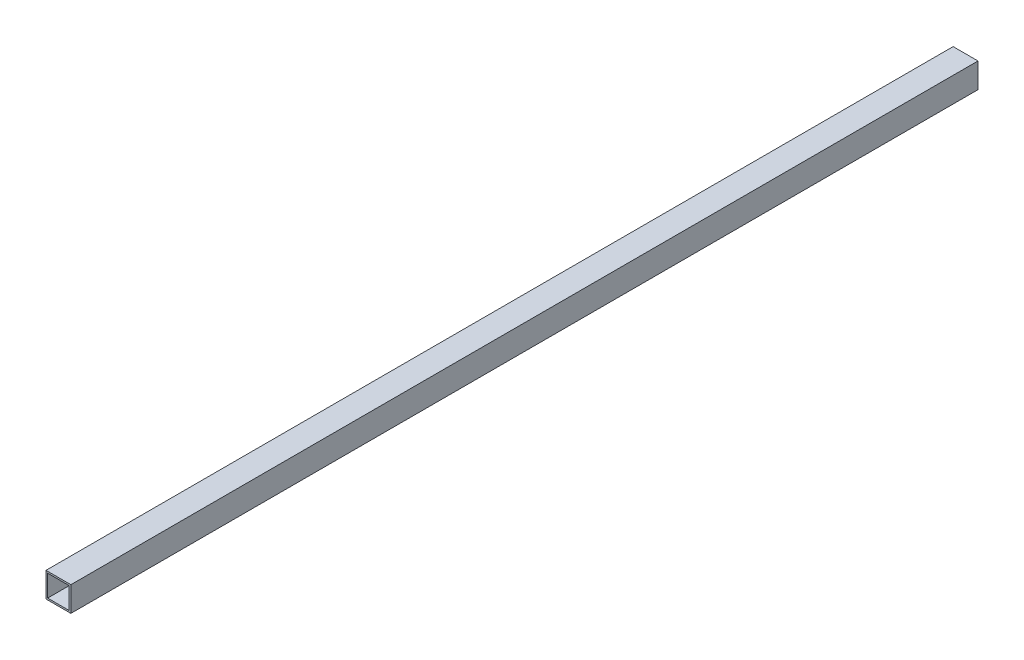
ISO-10303-21;
HEADER;
FILE_DESCRIPTION(('STEP AP214'),'2;1');
FILE_NAME('part.step','',(''),(''),'','','');
FILE_SCHEMA(('AUTOMOTIVE_DESIGN { 1 0 10303 214 1 1 1 1 }'));
ENDSEC;
DATA;
#1=APPLICATION_CONTEXT('core data for automotive mechanical design processes');
#2=APPLICATION_PROTOCOL_DEFINITION('international standard','automotive_design',2000,#1);
#3=PRODUCT_CONTEXT('',#1,'mechanical');
#4=PRODUCT('Part','Part','',(#3));
#5=PRODUCT_RELATED_PRODUCT_CATEGORY('part','',(#4));
#6=PRODUCT_DEFINITION_FORMATION('','',#4);
#7=PRODUCT_DEFINITION_CONTEXT('part definition',#1,'design');
#8=PRODUCT_DEFINITION('design','',#6,#7);
#9=PRODUCT_DEFINITION_SHAPE('','',#8);
#10=(LENGTH_UNIT() NAMED_UNIT(*) SI_UNIT(.MILLI.,.METRE.));
#11=(NAMED_UNIT(*) PLANE_ANGLE_UNIT() SI_UNIT($,.RADIAN.));
#12=(NAMED_UNIT(*) SI_UNIT($,.STERADIAN.) SOLID_ANGLE_UNIT());
#13=UNCERTAINTY_MEASURE_WITH_UNIT(LENGTH_MEASURE(1.E-05),#10,'distance_accuracy_value','');
#14=(GEOMETRIC_REPRESENTATION_CONTEXT(3) GLOBAL_UNCERTAINTY_ASSIGNED_CONTEXT((#13)) GLOBAL_UNIT_ASSIGNED_CONTEXT((#10,
#11,#12)) REPRESENTATION_CONTEXT('',''));
#15=CARTESIAN_POINT('',(0.,0.,0.));
#16=DIRECTION('',(0.,0.,1.));
#17=DIRECTION('',(1.,0.,0.));
#18=AXIS2_PLACEMENT_3D('',#15,#16,#17);
#19=CARTESIAN_POINT('',(-30.,30.,0.));
#20=DIRECTION('',(-1.,0.,0.));
#21=DIRECTION('',(0.,0.,1.));
#22=AXIS2_PLACEMENT_3D('',#19,#20,#21);
#23=PLANE('',#22);
#24=DIRECTION('',(0.,0.,1.));
#25=VECTOR('',#24,1.);
#26=CARTESIAN_POINT('',(-30.,-30.,0.));
#27=LINE('',#26,#25);
#28=CARTESIAN_POINT('',(-30.,-30.,0.));
#29=VERTEX_POINT('',#28);
#30=CARTESIAN_POINT('',(-30.,-30.,2188.));
#31=VERTEX_POINT('',#30);
#32=EDGE_CURVE('E92',#29,#31,#27,.T.);
#33=ORIENTED_EDGE('',*,*,#32,.T.);
#34=DIRECTION('',(0.,-1.,0.));
#35=VECTOR('',#34,1.);
#36=CARTESIAN_POINT('',(-30.,30.,2188.));
#37=LINE('',#36,#35);
#38=CARTESIAN_POINT('',(-30.,30.,2188.));
#39=VERTEX_POINT('',#38);
#40=EDGE_CURVE('E114',#39,#31,#37,.T.);
#41=ORIENTED_EDGE('',*,*,#40,.F.);
#42=DIRECTION('',(0.,0.,1.));
#43=VECTOR('',#42,1.);
#44=CARTESIAN_POINT('',(-30.,30.,0.));
#45=LINE('',#44,#43);
#46=CARTESIAN_POINT('',(-30.,30.,0.));
#47=VERTEX_POINT('',#46);
#48=EDGE_CURVE('E95',#47,#39,#45,.T.);
#49=ORIENTED_EDGE('',*,*,#48,.F.);
#50=DIRECTION('',(0.,-1.,0.));
#51=VECTOR('',#50,1.);
#52=CARTESIAN_POINT('',(-30.,30.,0.));
#53=LINE('',#52,#51);
#54=EDGE_CURVE('E91',#47,#29,#53,.T.);
#55=ORIENTED_EDGE('',*,*,#54,.T.);
#56=EDGE_LOOP('',(#33,#41,#49,#55));
#57=FACE_BOUND('',#56,.T.);
#58=ADVANCED_FACE('F35',(#57),#23,.T.);
#59=CARTESIAN_POINT('',(-30.,-30.,0.));
#60=DIRECTION('',(0.,-1.,0.));
#61=DIRECTION('',(0.,0.,-1.));
#62=AXIS2_PLACEMENT_3D('',#59,#60,#61);
#63=PLANE('',#62);
#64=DIRECTION('',(0.,0.,1.));
#65=VECTOR('',#64,1.);
#66=CARTESIAN_POINT('',(30.,-30.,0.));
#67=LINE('',#66,#65);
#68=CARTESIAN_POINT('',(30.,-30.,0.));
#69=VERTEX_POINT('',#68);
#70=CARTESIAN_POINT('',(30.,-30.,2188.));
#71=VERTEX_POINT('',#70);
#72=EDGE_CURVE('E102',#69,#71,#67,.T.);
#73=ORIENTED_EDGE('',*,*,#72,.T.);
#74=DIRECTION('',(1.,0.,0.));
#75=VECTOR('',#74,1.);
#76=CARTESIAN_POINT('',(-30.,-30.,2188.));
#77=LINE('',#76,#75);
#78=EDGE_CURVE('E101',#31,#71,#77,.T.);
#79=ORIENTED_EDGE('',*,*,#78,.F.);
#80=ORIENTED_EDGE('',*,*,#32,.F.);
#81=DIRECTION('',(1.,0.,0.));
#82=VECTOR('',#81,1.);
#83=CARTESIAN_POINT('',(-30.,-30.,0.));
#84=LINE('',#83,#82);
#85=EDGE_CURVE('E84',#29,#69,#84,.T.);
#86=ORIENTED_EDGE('',*,*,#85,.T.);
#87=EDGE_LOOP('',(#73,#79,#80,#86));
#88=FACE_BOUND('',#87,.T.);
#89=ADVANCED_FACE('F99',(#88),#63,.T.);
#90=CARTESIAN_POINT('',(30.,30.,0.));
#91=DIRECTION('',(1.,0.,0.));
#92=DIRECTION('',(0.,0.,-1.));
#93=AXIS2_PLACEMENT_3D('',#90,#91,#92);
#94=PLANE('',#93);
#95=DIRECTION('',(0.,0.,1.));
#96=VECTOR('',#95,1.);
#97=CARTESIAN_POINT('',(30.,30.,0.));
#98=LINE('',#97,#96);
#99=CARTESIAN_POINT('',(30.,30.,0.));
#100=VERTEX_POINT('',#99);
#101=CARTESIAN_POINT('',(30.,30.,2188.));
#102=VERTEX_POINT('',#101);
#103=EDGE_CURVE('E39',#100,#102,#98,.T.);
#104=ORIENTED_EDGE('',*,*,#103,.T.);
#105=DIRECTION('',(0.,1.,0.));
#106=VECTOR('',#105,1.);
#107=CARTESIAN_POINT('',(30.,30.,2188.));
#108=LINE('',#107,#106);
#109=EDGE_CURVE('E111',#71,#102,#108,.T.);
#110=ORIENTED_EDGE('',*,*,#109,.F.);
#111=ORIENTED_EDGE('',*,*,#72,.F.);
#112=DIRECTION('',(0.,1.,0.));
#113=VECTOR('',#112,1.);
#114=CARTESIAN_POINT('',(30.,30.,0.));
#115=LINE('',#114,#113);
#116=EDGE_CURVE('E106',#69,#100,#115,.T.);
#117=ORIENTED_EDGE('',*,*,#116,.T.);
#118=EDGE_LOOP('',(#104,#110,#111,#117));
#119=FACE_BOUND('',#118,.T.);
#120=ADVANCED_FACE('F120',(#119),#94,.T.);
#121=CARTESIAN_POINT('',(-30.,30.,0.));
#122=DIRECTION('',(0.,1.,0.));
#123=DIRECTION('',(0.,0.,1.));
#124=AXIS2_PLACEMENT_3D('',#121,#122,#123);
#125=PLANE('',#124);
#126=DIRECTION('',(-1.,0.,0.));
#127=VECTOR('',#126,1.);
#128=CARTESIAN_POINT('',(-30.,30.,2188.));
#129=LINE('',#128,#127);
#130=EDGE_CURVE('E125',#102,#39,#129,.T.);
#131=ORIENTED_EDGE('',*,*,#130,.F.);
#132=ORIENTED_EDGE('',*,*,#103,.F.);
#133=DIRECTION('',(-1.,0.,0.));
#134=VECTOR('',#133,1.);
#135=CARTESIAN_POINT('',(-30.,30.,0.));
#136=LINE('',#135,#134);
#137=EDGE_CURVE('E108',#100,#47,#136,.T.);
#138=ORIENTED_EDGE('',*,*,#137,.T.);
#139=ORIENTED_EDGE('',*,*,#48,.T.);
#140=EDGE_LOOP('',(#131,#132,#138,#139));
#141=FACE_BOUND('',#140,.T.);
#142=ADVANCED_FACE('F37',(#141),#125,.T.);
#143=CARTESIAN_POINT('',(0.,0.,0.));
#144=DIRECTION('',(0.,0.,1.));
#145=DIRECTION('',(1.,0.,0.));
#146=AXIS2_PLACEMENT_3D('',#143,#144,#145);
#147=PLANE('',#146);
#148=DIRECTION('',(0.,-1.,0.));
#149=VECTOR('',#148,1.);
#150=CARTESIAN_POINT('',(-26.,26.,0.));
#151=LINE('',#150,#149);
#152=CARTESIAN_POINT('',(-26.,-26.,0.));
#153=VERTEX_POINT('',#152);
#154=CARTESIAN_POINT('',(-26.,26.,0.));
#155=VERTEX_POINT('',#154);
#156=EDGE_CURVE('E130',#153,#155,#151,.F.);
#157=ORIENTED_EDGE('',*,*,#156,.F.);
#158=DIRECTION('',(1.,0.,0.));
#159=VECTOR('',#158,1.);
#160=CARTESIAN_POINT('',(-26.,-26.,0.));
#161=LINE('',#160,#159);
#162=CARTESIAN_POINT('',(26.,-26.,0.));
#163=VERTEX_POINT('',#162);
#164=EDGE_CURVE('E134',#163,#153,#161,.F.);
#165=ORIENTED_EDGE('',*,*,#164,.F.);
#166=DIRECTION('',(0.,1.,0.));
#167=VECTOR('',#166,1.);
#168=CARTESIAN_POINT('',(26.,26.,0.));
#169=LINE('',#168,#167);
#170=CARTESIAN_POINT('',(26.,26.,0.));
#171=VERTEX_POINT('',#170);
#172=EDGE_CURVE('E141',#171,#163,#169,.F.);
#173=ORIENTED_EDGE('',*,*,#172,.F.);
#174=DIRECTION('',(-1.,0.,0.));
#175=VECTOR('',#174,1.);
#176=CARTESIAN_POINT('',(-26.,26.,0.));
#177=LINE('',#176,#175);
#178=EDGE_CURVE('E126',#155,#171,#177,.F.);
#179=ORIENTED_EDGE('',*,*,#178,.F.);
#180=EDGE_LOOP('',(#157,#165,#173,#179));
#181=FACE_BOUND('',#180,.T.);
#182=ORIENTED_EDGE('',*,*,#54,.F.);
#183=ORIENTED_EDGE('',*,*,#137,.F.);
#184=ORIENTED_EDGE('',*,*,#116,.F.);
#185=ORIENTED_EDGE('',*,*,#85,.F.);
#186=EDGE_LOOP('',(#182,#183,#184,#185));
#187=FACE_BOUND('',#186,.T.);
#188=ADVANCED_FACE('F105',(#181,#187),#147,.F.);
#189=CARTESIAN_POINT('',(0.,0.,2188.));
#190=DIRECTION('',(0.,0.,1.));
#191=DIRECTION('',(1.,0.,0.));
#192=AXIS2_PLACEMENT_3D('',#189,#190,#191);
#193=PLANE('',#192);
#194=DIRECTION('',(0.,-1.,0.));
#195=VECTOR('',#194,1.);
#196=CARTESIAN_POINT('',(-26.,26.,2188.));
#197=LINE('',#196,#195);
#198=CARTESIAN_POINT('',(-26.,-26.,2188.));
#199=VERTEX_POINT('',#198);
#200=CARTESIAN_POINT('',(-26.,26.,2188.));
#201=VERTEX_POINT('',#200);
#202=EDGE_CURVE('E11',#199,#201,#197,.F.);
#203=ORIENTED_EDGE('',*,*,#202,.T.);
#204=DIRECTION('',(-1.,0.,0.));
#205=VECTOR('',#204,1.);
#206=CARTESIAN_POINT('',(-26.,26.,2188.));
#207=LINE('',#206,#205);
#208=CARTESIAN_POINT('',(26.,26.,2188.));
#209=VERTEX_POINT('',#208);
#210=EDGE_CURVE('E151',#201,#209,#207,.F.);
#211=ORIENTED_EDGE('',*,*,#210,.T.);
#212=DIRECTION('',(0.,1.,0.));
#213=VECTOR('',#212,1.);
#214=CARTESIAN_POINT('',(26.,26.,2188.));
#215=LINE('',#214,#213);
#216=CARTESIAN_POINT('',(26.,-26.,2188.));
#217=VERTEX_POINT('',#216);
#218=EDGE_CURVE('E144',#209,#217,#215,.F.);
#219=ORIENTED_EDGE('',*,*,#218,.T.);
#220=DIRECTION('',(1.,0.,0.));
#221=VECTOR('',#220,1.);
#222=CARTESIAN_POINT('',(-26.,-26.,2188.));
#223=LINE('',#222,#221);
#224=EDGE_CURVE('E53',#217,#199,#223,.F.);
#225=ORIENTED_EDGE('',*,*,#224,.T.);
#226=EDGE_LOOP('',(#203,#211,#219,#225));
#227=FACE_BOUND('',#226,.T.);
#228=ORIENTED_EDGE('',*,*,#40,.T.);
#229=ORIENTED_EDGE('',*,*,#78,.T.);
#230=ORIENTED_EDGE('',*,*,#109,.T.);
#231=ORIENTED_EDGE('',*,*,#130,.T.);
#232=EDGE_LOOP('',(#228,#229,#230,#231));
#233=FACE_BOUND('',#232,.T.);
#234=ADVANCED_FACE('F124',(#227,#233),#193,.T.);
#235=CARTESIAN_POINT('',(-26.,26.,0.));
#236=DIRECTION('',(0.,-1.,0.));
#237=DIRECTION('',(0.,0.,-1.));
#238=AXIS2_PLACEMENT_3D('',#235,#236,#237);
#239=PLANE('',#238);
#240=DIRECTION('',(0.,0.,1.));
#241=VECTOR('',#240,1.);
#242=CARTESIAN_POINT('',(26.,26.,0.));
#243=LINE('',#242,#241);
#244=EDGE_CURVE('E146',#171,#209,#243,.T.);
#245=ORIENTED_EDGE('',*,*,#244,.T.);
#246=ORIENTED_EDGE('',*,*,#210,.F.);
#247=DIRECTION('',(0.,0.,1.));
#248=VECTOR('',#247,1.);
#249=CARTESIAN_POINT('',(-26.,26.,0.));
#250=LINE('',#249,#248);
#251=EDGE_CURVE('E133',#155,#201,#250,.T.);
#252=ORIENTED_EDGE('',*,*,#251,.F.);
#253=ORIENTED_EDGE('',*,*,#178,.T.);
#254=EDGE_LOOP('',(#245,#246,#252,#253));
#255=FACE_BOUND('',#254,.T.);
#256=ADVANCED_FACE('F162',(#255),#239,.T.);
#257=CARTESIAN_POINT('',(26.,26.,0.));
#258=DIRECTION('',(-1.,0.,0.));
#259=DIRECTION('',(0.,0.,1.));
#260=AXIS2_PLACEMENT_3D('',#257,#258,#259);
#261=PLANE('',#260);
#262=DIRECTION('',(0.,0.,1.));
#263=VECTOR('',#262,1.);
#264=CARTESIAN_POINT('',(26.,-26.,0.));
#265=LINE('',#264,#263);
#266=EDGE_CURVE('E138',#163,#217,#265,.T.);
#267=ORIENTED_EDGE('',*,*,#266,.T.);
#268=ORIENTED_EDGE('',*,*,#218,.F.);
#269=ORIENTED_EDGE('',*,*,#244,.F.);
#270=ORIENTED_EDGE('',*,*,#172,.T.);
#271=EDGE_LOOP('',(#267,#268,#269,#270));
#272=FACE_BOUND('',#271,.T.);
#273=ADVANCED_FACE('F171',(#272),#261,.T.);
#274=CARTESIAN_POINT('',(-26.,-26.,0.));
#275=DIRECTION('',(0.,1.,0.));
#276=DIRECTION('',(0.,0.,1.));
#277=AXIS2_PLACEMENT_3D('',#274,#275,#276);
#278=PLANE('',#277);
#279=DIRECTION('',(0.,0.,1.));
#280=VECTOR('',#279,1.);
#281=CARTESIAN_POINT('',(-26.,-26.,0.));
#282=LINE('',#281,#280);
#283=EDGE_CURVE('E45',#153,#199,#282,.T.);
#284=ORIENTED_EDGE('',*,*,#283,.T.);
#285=ORIENTED_EDGE('',*,*,#224,.F.);
#286=ORIENTED_EDGE('',*,*,#266,.F.);
#287=ORIENTED_EDGE('',*,*,#164,.T.);
#288=EDGE_LOOP('',(#284,#285,#286,#287));
#289=FACE_BOUND('',#288,.T.);
#290=ADVANCED_FACE('F176',(#289),#278,.T.);
#291=CARTESIAN_POINT('',(-26.,26.,0.));
#292=DIRECTION('',(1.,0.,0.));
#293=DIRECTION('',(0.,0.,-1.));
#294=AXIS2_PLACEMENT_3D('',#291,#292,#293);
#295=PLANE('',#294);
#296=ORIENTED_EDGE('',*,*,#202,.F.);
#297=ORIENTED_EDGE('',*,*,#283,.F.);
#298=ORIENTED_EDGE('',*,*,#156,.T.);
#299=ORIENTED_EDGE('',*,*,#251,.T.);
#300=EDGE_LOOP('',(#296,#297,#298,#299));
#301=FACE_BOUND('',#300,.T.);
#302=ADVANCED_FACE('F180',(#301),#295,.T.);
#303=CLOSED_SHELL('',(#58,#89,#120,#142,#188,#234,#256,#273,#290,#302));
#304=MANIFOLD_SOLID_BREP('B2',#303);
#305=ADVANCED_BREP_SHAPE_REPRESENTATION('',(#18,#304),#14);
#306=SHAPE_DEFINITION_REPRESENTATION(#9,#305);
ENDSEC;
END-ISO-10303-21;
